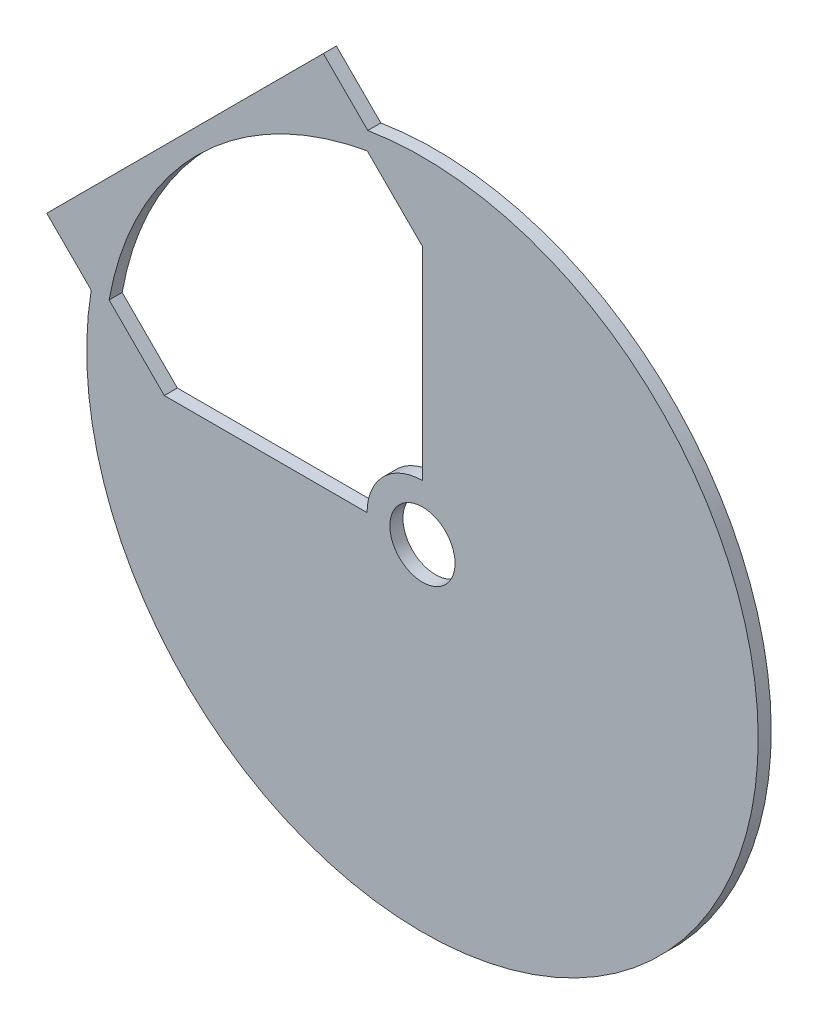
ISO-10303-21;
HEADER;
FILE_DESCRIPTION(('STEP AP214'),'2;1');
FILE_NAME('part.step','',(''),(''),'','','');
FILE_SCHEMA(('AUTOMOTIVE_DESIGN { 1 0 10303 214 1 1 1 1 }'));
ENDSEC;
DATA;
#1=APPLICATION_CONTEXT('core data for automotive mechanical design processes');
#2=APPLICATION_PROTOCOL_DEFINITION('international standard','automotive_design',2000,#1);
#3=PRODUCT_CONTEXT('',#1,'mechanical');
#4=PRODUCT('Part','Part','',(#3));
#5=PRODUCT_RELATED_PRODUCT_CATEGORY('part','',(#4));
#6=PRODUCT_DEFINITION_FORMATION('','',#4);
#7=PRODUCT_DEFINITION_CONTEXT('part definition',#1,'design');
#8=PRODUCT_DEFINITION('design','',#6,#7);
#9=PRODUCT_DEFINITION_SHAPE('','',#8);
#10=(LENGTH_UNIT() NAMED_UNIT(*) SI_UNIT(.MILLI.,.METRE.));
#11=(NAMED_UNIT(*) PLANE_ANGLE_UNIT() SI_UNIT($,.RADIAN.));
#12=(NAMED_UNIT(*) SI_UNIT($,.STERADIAN.) SOLID_ANGLE_UNIT());
#13=UNCERTAINTY_MEASURE_WITH_UNIT(LENGTH_MEASURE(1.E-05),#10,'distance_accuracy_value','');
#14=(GEOMETRIC_REPRESENTATION_CONTEXT(3) GLOBAL_UNCERTAINTY_ASSIGNED_CONTEXT((#13)) GLOBAL_UNIT_ASSIGNED_CONTEXT((#10,
#11,#12)) REPRESENTATION_CONTEXT('',''));
#15=CARTESIAN_POINT('',(0.,0.,0.));
#16=DIRECTION('',(0.,0.,1.));
#17=DIRECTION('',(1.,0.,0.));
#18=AXIS2_PLACEMENT_3D('',#15,#16,#17);
#19=CARTESIAN_POINT('',(0.,0.,0.));
#20=DIRECTION('',(0.,0.,-1.));
#21=DIRECTION('',(-1.,0.,0.));
#22=AXIS2_PLACEMENT_3D('',#19,#20,#21);
#23=CYLINDRICAL_SURFACE('',#22,48.8);
#24=DIRECTION('',(0.,0.,1.));
#25=VECTOR('',#24,1.);
#26=CARTESIAN_POINT('',(-48.0606246454725,8.46264489902557,0.));
#27=LINE('',#26,#25);
#28=CARTESIAN_POINT('',(-48.0606246454725,8.46264489902549,-2.));
#29=VERTEX_POINT('',#28);
#30=CARTESIAN_POINT('',(-48.0606246454725,8.46264489902557,0.));
#31=VERTEX_POINT('',#30);
#32=EDGE_CURVE('E11',#29,#31,#27,.T.);
#33=ORIENTED_EDGE('',*,*,#32,.F.);
#34=CARTESIAN_POINT('',(0.,0.,-2.));
#35=DIRECTION('',(0.,0.,1.));
#36=DIRECTION('',(1.,0.,0.));
#37=AXIS2_PLACEMENT_3D('',#34,#35,#36);
#38=CIRCLE('',#37,48.8);
#39=CARTESIAN_POINT('',(-8.46264489902599,48.0606246454725,-1.99999999999999));
#40=VERTEX_POINT('',#39);
#41=EDGE_CURVE('E115',#40,#29,#38,.T.);
#42=ORIENTED_EDGE('',*,*,#41,.F.);
#43=DIRECTION('',(0.,0.,1.));
#44=VECTOR('',#43,1.);
#45=CARTESIAN_POINT('',(-8.46264489902608,48.0606246454724,0.));
#46=LINE('',#45,#44);
#47=CARTESIAN_POINT('',(-8.46264489902608,48.0606246454724,0.));
#48=VERTEX_POINT('',#47);
#49=EDGE_CURVE('E51',#40,#48,#46,.T.);
#50=ORIENTED_EDGE('',*,*,#49,.T.);
#51=CARTESIAN_POINT('',(0.,0.,0.));
#52=DIRECTION('',(0.,0.,1.));
#53=DIRECTION('',(1.,0.,0.));
#54=AXIS2_PLACEMENT_3D('',#51,#52,#53);
#55=CIRCLE('',#54,48.8);
#56=EDGE_CURVE('E159',#48,#31,#55,.T.);
#57=ORIENTED_EDGE('',*,*,#56,.T.);
#58=EDGE_LOOP('',(#33,#42,#50,#57));
#59=FACE_BOUND('',#58,.T.);
#60=ADVANCED_FACE('F41',(#59),#23,.F.);
#61=CARTESIAN_POINT('',(19.7989898732232,19.7989898732234,0.));
#62=DIRECTION('',(0.707106781186544,0.707106781186551,0.));
#63=DIRECTION('',(0.707106781186552,-0.707106781186545,0.));
#64=AXIS2_PLACEMENT_3D('',#61,#62,#63);
#65=PLANE('',#64);
#66=ORIENTED_EDGE('',*,*,#49,.F.);
#67=DIRECTION('',(0.707106781186552,-0.707106781186545,0.));
#68=VECTOR('',#67,1.);
#69=CARTESIAN_POINT('',(19.7989898732232,19.7989898732234,-2.));
#70=LINE('',#69,#68);
#71=CARTESIAN_POINT('',(0.,39.5979797464465,-2.));
#72=VERTEX_POINT('',#71);
#73=EDGE_CURVE('E133',#40,#72,#70,.T.);
#74=ORIENTED_EDGE('',*,*,#73,.T.);
#75=DIRECTION('',(0.,0.,1.));
#76=VECTOR('',#75,1.);
#77=CARTESIAN_POINT('',(0.,39.5979797464465,0.));
#78=LINE('',#77,#76);
#79=CARTESIAN_POINT('',(0.,39.5979797464465,0.));
#80=VERTEX_POINT('',#79);
#81=EDGE_CURVE('E152',#72,#80,#78,.T.);
#82=ORIENTED_EDGE('',*,*,#81,.T.);
#83=DIRECTION('',(0.707106781186552,-0.707106781186545,0.));
#84=VECTOR('',#83,1.);
#85=CARTESIAN_POINT('',(19.7989898732232,19.7989898732234,0.));
#86=LINE('',#85,#84);
#87=EDGE_CURVE('E167',#48,#80,#86,.T.);
#88=ORIENTED_EDGE('',*,*,#87,.F.);
#89=EDGE_LOOP('',(#66,#74,#82,#88));
#90=FACE_BOUND('',#89,.T.);
#91=ADVANCED_FACE('F170',(#90),#65,.F.);
#92=CARTESIAN_POINT('',(0.,0.,0.));
#93=DIRECTION('',(-1.,0.,0.));
#94=DIRECTION('',(0.,1.,0.));
#95=AXIS2_PLACEMENT_3D('',#92,#93,#94);
#96=PLANE('',#95);
#97=ORIENTED_EDGE('',*,*,#81,.F.);
#98=DIRECTION('',(0.,1.,0.));
#99=VECTOR('',#98,1.);
#100=CARTESIAN_POINT('',(0.,0.,-2.));
#101=LINE('',#100,#99);
#102=CARTESIAN_POINT('',(0.,8.49999999999999,-2.));
#103=VERTEX_POINT('',#102);
#104=EDGE_CURVE('E130',#103,#72,#101,.T.);
#105=ORIENTED_EDGE('',*,*,#104,.F.);
#106=DIRECTION('',(0.,0.,1.));
#107=VECTOR('',#106,1.);
#108=CARTESIAN_POINT('',(0.,8.5,0.));
#109=LINE('',#108,#107);
#110=CARTESIAN_POINT('',(0.,8.5,0.));
#111=VERTEX_POINT('',#110);
#112=EDGE_CURVE('E150',#103,#111,#109,.T.);
#113=ORIENTED_EDGE('',*,*,#112,.T.);
#114=DIRECTION('',(0.,1.,0.));
#115=VECTOR('',#114,1.);
#116=CARTESIAN_POINT('',(0.,0.,0.));
#117=LINE('',#116,#115);
#118=EDGE_CURVE('E171',#111,#80,#117,.T.);
#119=ORIENTED_EDGE('',*,*,#118,.T.);
#120=EDGE_LOOP('',(#97,#105,#113,#119));
#121=FACE_BOUND('',#120,.T.);
#122=ADVANCED_FACE('F229',(#121),#96,.T.);
#123=CARTESIAN_POINT('',(0.,0.,0.));
#124=DIRECTION('',(0.,0.,-1.));
#125=DIRECTION('',(-1.,0.,0.));
#126=AXIS2_PLACEMENT_3D('',#123,#124,#125);
#127=CYLINDRICAL_SURFACE('',#126,8.49999999999999);
#128=ORIENTED_EDGE('',*,*,#112,.F.);
#129=CARTESIAN_POINT('',(0.,0.,-2.));
#130=DIRECTION('',(0.,0.,1.));
#131=DIRECTION('',(1.,0.,0.));
#132=AXIS2_PLACEMENT_3D('',#129,#130,#131);
#133=CIRCLE('',#132,8.49999999999999);
#134=CARTESIAN_POINT('',(-8.49999999999999,0.,-2.));
#135=VERTEX_POINT('',#134);
#136=EDGE_CURVE('E127',#103,#135,#133,.T.);
#137=ORIENTED_EDGE('',*,*,#136,.T.);
#138=DIRECTION('',(0.,0.,1.));
#139=VECTOR('',#138,1.);
#140=CARTESIAN_POINT('',(-8.5,0.,0.));
#141=LINE('',#140,#139);
#142=CARTESIAN_POINT('',(-8.5,0.,0.));
#143=VERTEX_POINT('',#142);
#144=EDGE_CURVE('E59',#135,#143,#141,.T.);
#145=ORIENTED_EDGE('',*,*,#144,.T.);
#146=CARTESIAN_POINT('',(0.,0.,0.));
#147=DIRECTION('',(0.,0.,1.));
#148=DIRECTION('',(1.,0.,0.));
#149=AXIS2_PLACEMENT_3D('',#146,#147,#148);
#150=CIRCLE('',#149,8.49999999999999);
#151=EDGE_CURVE('E148',#111,#143,#150,.T.);
#152=ORIENTED_EDGE('',*,*,#151,.F.);
#153=EDGE_LOOP('',(#128,#137,#145,#152));
#154=FACE_BOUND('',#153,.T.);
#155=ADVANCED_FACE('F226',(#154),#127,.T.);
#156=CARTESIAN_POINT('',(0.,-4.30211422042248E-13,0.));
#157=DIRECTION('',(0.,-1.,0.));
#158=DIRECTION('',(-1.,0.,0.));
#159=AXIS2_PLACEMENT_3D('',#156,#157,#158);
#160=PLANE('',#159);
#161=ORIENTED_EDGE('',*,*,#144,.F.);
#162=DIRECTION('',(-1.,0.,0.));
#163=VECTOR('',#162,1.);
#164=CARTESIAN_POINT('',(0.,0.,-2.));
#165=LINE('',#164,#163);
#166=CARTESIAN_POINT('',(-39.5979797464465,-3.81763039967688E-13,-1.99999999999999));
#167=VERTEX_POINT('',#166);
#168=EDGE_CURVE('E113',#135,#167,#165,.T.);
#169=ORIENTED_EDGE('',*,*,#168,.T.);
#170=DIRECTION('',(0.,0.,1.));
#171=VECTOR('',#170,1.);
#172=CARTESIAN_POINT('',(-39.5979797464465,-3.81639164714898E-13,0.));
#173=LINE('',#172,#171);
#174=CARTESIAN_POINT('',(-39.5979797464465,-3.81639164714898E-13,0.));
#175=VERTEX_POINT('',#174);
#176=EDGE_CURVE('E45',#167,#175,#173,.T.);
#177=ORIENTED_EDGE('',*,*,#176,.T.);
#178=DIRECTION('',(-1.,0.,0.));
#179=VECTOR('',#178,1.);
#180=CARTESIAN_POINT('',(0.,-4.30211422042248E-13,0.));
#181=LINE('',#180,#179);
#182=EDGE_CURVE('E222',#143,#175,#181,.T.);
#183=ORIENTED_EDGE('',*,*,#182,.F.);
#184=EDGE_LOOP('',(#161,#169,#177,#183));
#185=FACE_BOUND('',#184,.T.);
#186=ADVANCED_FACE('F117',(#185),#160,.F.);
#187=CARTESIAN_POINT('',(-57.6292026667038,15.2027957955105,0.));
#188=DIRECTION('',(-0.707106781186544,-0.707106781186551,0.));
#189=DIRECTION('',(-0.707106781186552,0.707106781186545,0.));
#190=AXIS2_PLACEMENT_3D('',#187,#188,#189);
#191=PLANE('',#190);
#192=DIRECTION('',(0.,0.,1.));
#193=VECTOR('',#192,1.);
#194=CARTESIAN_POINT('',(-57.6292026667038,15.2027957955105,0.));
#195=LINE('',#194,#193);
#196=CARTESIAN_POINT('',(-57.6292026667038,15.2027957955105,-1.99999999999999));
#197=VERTEX_POINT('',#196);
#198=CARTESIAN_POINT('',(-57.6292026667038,15.2027957955105,0.));
#199=VERTEX_POINT('',#198);
#200=EDGE_CURVE('E108',#197,#199,#195,.T.);
#201=ORIENTED_EDGE('',*,*,#200,.F.);
#202=DIRECTION('',(-0.707106781186552,0.707106781186545,0.));
#203=VECTOR('',#202,1.);
#204=CARTESIAN_POINT('',(-57.6292026667038,15.2027957955105,-2.));
#205=LINE('',#204,#203);
#206=CARTESIAN_POINT('',(-50.8126122134759,8.38620534228259,-2.));
#207=VERTEX_POINT('',#206);
#208=EDGE_CURVE('E121',#207,#197,#205,.T.);
#209=ORIENTED_EDGE('',*,*,#208,.F.);
#210=DIRECTION('',(0.,0.,1.));
#211=VECTOR('',#210,1.);
#212=CARTESIAN_POINT('',(-50.8126122134759,8.38620534228268,0.));
#213=LINE('',#212,#211);
#214=CARTESIAN_POINT('',(-50.8126122134759,8.38620534228268,0.));
#215=VERTEX_POINT('',#214);
#216=EDGE_CURVE('E140',#207,#215,#213,.T.);
#217=ORIENTED_EDGE('',*,*,#216,.T.);
#218=DIRECTION('',(-0.707106781186552,0.707106781186545,0.));
#219=VECTOR('',#218,1.);
#220=CARTESIAN_POINT('',(-57.6292026667038,15.2027957955105,0.));
#221=LINE('',#220,#219);
#222=EDGE_CURVE('E218',#215,#199,#221,.T.);
#223=ORIENTED_EDGE('',*,*,#222,.T.);
#224=EDGE_LOOP('',(#201,#209,#217,#223));
#225=FACE_BOUND('',#224,.T.);
#226=ADVANCED_FACE('F220',(#225),#191,.T.);
#227=CARTESIAN_POINT('',(0.,0.,0.));
#228=DIRECTION('',(0.,0.,-1.));
#229=DIRECTION('',(-1.,0.,0.));
#230=AXIS2_PLACEMENT_3D('',#227,#228,#229);
#231=CYLINDRICAL_SURFACE('',#230,51.5);
#232=ORIENTED_EDGE('',*,*,#216,.F.);
#233=CARTESIAN_POINT('',(0.,0.,-2.));
#234=DIRECTION('',(0.,0.,-1.));
#235=DIRECTION('',(-1.,0.,0.));
#236=AXIS2_PLACEMENT_3D('',#233,#234,#235);
#237=CIRCLE('',#236,51.5);
#238=CARTESIAN_POINT('',(-8.38620534228314,50.8126122134758,-1.99999999999999));
#239=VERTEX_POINT('',#238);
#240=EDGE_CURVE('E118',#239,#207,#237,.T.);
#241=ORIENTED_EDGE('',*,*,#240,.F.);
#242=DIRECTION('',(0.,0.,1.));
#243=VECTOR('',#242,1.);
#244=CARTESIAN_POINT('',(-8.38620534228322,50.8126122134757,0.));
#245=LINE('',#244,#243);
#246=CARTESIAN_POINT('',(-8.38620534228322,50.8126122134757,0.));
#247=VERTEX_POINT('',#246);
#248=EDGE_CURVE('E137',#239,#247,#245,.T.);
#249=ORIENTED_EDGE('',*,*,#248,.T.);
#250=CARTESIAN_POINT('',(0.,0.,0.));
#251=DIRECTION('',(0.,0.,-1.));
#252=DIRECTION('',(-1.,0.,0.));
#253=AXIS2_PLACEMENT_3D('',#250,#251,#252);
#254=CIRCLE('',#253,51.5);
#255=EDGE_CURVE('E202',#247,#215,#254,.T.);
#256=ORIENTED_EDGE('',*,*,#255,.T.);
#257=EDGE_LOOP('',(#232,#241,#249,#256));
#258=FACE_BOUND('',#257,.T.);
#259=ADVANCED_FACE('F200',(#258),#231,.T.);
#260=CARTESIAN_POINT('',(-15.2027957955111,57.6292026667036,0.));
#261=DIRECTION('',(0.707106781186545,0.70710678118655,0.));
#262=DIRECTION('',(0.707106781186551,-0.707106781186546,0.));
#263=AXIS2_PLACEMENT_3D('',#260,#261,#262);
#264=PLANE('',#263);
#265=ORIENTED_EDGE('',*,*,#248,.F.);
#266=DIRECTION('',(0.707106781186551,-0.707106781186546,0.));
#267=VECTOR('',#266,1.);
#268=CARTESIAN_POINT('',(-15.2027957955111,57.6292026667036,-2.));
#269=LINE('',#268,#267);
#270=CARTESIAN_POINT('',(-15.2027957955111,57.6292026667036,-2.));
#271=VERTEX_POINT('',#270);
#272=EDGE_CURVE('E181',#271,#239,#269,.T.);
#273=ORIENTED_EDGE('',*,*,#272,.F.);
#274=DIRECTION('',(0.,0.,1.));
#275=VECTOR('',#274,1.);
#276=CARTESIAN_POINT('',(-15.2027957955111,57.6292026667036,0.));
#277=LINE('',#276,#275);
#278=CARTESIAN_POINT('',(-15.2027957955111,57.6292026667036,0.));
#279=VERTEX_POINT('',#278);
#280=EDGE_CURVE('E141',#271,#279,#277,.T.);
#281=ORIENTED_EDGE('',*,*,#280,.T.);
#282=DIRECTION('',(0.707106781186551,-0.707106781186546,0.));
#283=VECTOR('',#282,1.);
#284=CARTESIAN_POINT('',(-15.2027957955111,57.6292026667036,0.));
#285=LINE('',#284,#283);
#286=EDGE_CURVE('E196',#279,#247,#285,.T.);
#287=ORIENTED_EDGE('',*,*,#286,.T.);
#288=EDGE_LOOP('',(#265,#273,#281,#287));
#289=FACE_BOUND('',#288,.T.);
#290=ADVANCED_FACE('F192',(#289),#264,.T.);
#291=CARTESIAN_POINT('',(0.,0.,0.));
#292=DIRECTION('',(0.,0.,-1.));
#293=DIRECTION('',(-1.,0.,0.));
#294=AXIS2_PLACEMENT_3D('',#291,#292,#293);
#295=CYLINDRICAL_SURFACE('',#294,5.);
#296=CARTESIAN_POINT('',(0.,0.,0.));
#297=DIRECTION('',(0.,0.,1.));
#298=DIRECTION('',(1.,0.,0.));
#299=AXIS2_PLACEMENT_3D('',#296,#297,#298);
#300=CIRCLE('',#299,5.);
#301=CARTESIAN_POINT('',(5.,0.,0.));
#302=VERTEX_POINT('',#301);
#303=EDGE_CURVE('E129',#302,#302,#300,.T.);
#304=ORIENTED_EDGE('',*,*,#303,.T.);
#305=EDGE_LOOP('',(#304));
#306=FACE_BOUND('',#305,.T.);
#307=CARTESIAN_POINT('',(0.,0.,-2.));
#308=DIRECTION('',(0.,0.,1.));
#309=DIRECTION('',(1.,0.,0.));
#310=AXIS2_PLACEMENT_3D('',#307,#308,#309);
#311=CIRCLE('',#310,5.);
#312=CARTESIAN_POINT('',(5.,0.,-2.));
#313=VERTEX_POINT('',#312);
#314=EDGE_CURVE('E178',#313,#313,#311,.T.);
#315=ORIENTED_EDGE('',*,*,#314,.F.);
#316=EDGE_LOOP('',(#315));
#317=FACE_BOUND('',#316,.T.);
#318=ADVANCED_FACE('F295',(#306,#317),#295,.F.);
#319=CARTESIAN_POINT('',(-15.2027957955111,57.6292026667036,0.));
#320=DIRECTION('',(-0.707106781186551,0.707106781186544,0.));
#321=DIRECTION('',(0.707106781186544,0.707106781186551,0.));
#322=AXIS2_PLACEMENT_3D('',#319,#320,#321);
#323=PLANE('',#322);
#324=DIRECTION('',(0.707106781186544,0.707106781186551,0.));
#325=VECTOR('',#324,1.);
#326=CARTESIAN_POINT('',(-15.2027957955111,57.6292026667036,-2.));
#327=LINE('',#326,#325);
#328=EDGE_CURVE('E125',#197,#271,#327,.T.);
#329=ORIENTED_EDGE('',*,*,#328,.F.);
#330=ORIENTED_EDGE('',*,*,#200,.T.);
#331=DIRECTION('',(0.707106781186544,0.707106781186551,0.));
#332=VECTOR('',#331,1.);
#333=CARTESIAN_POINT('',(-15.2027957955111,57.6292026667036,0.));
#334=LINE('',#333,#332);
#335=EDGE_CURVE('E213',#199,#279,#334,.T.);
#336=ORIENTED_EDGE('',*,*,#335,.T.);
#337=ORIENTED_EDGE('',*,*,#280,.F.);
#338=EDGE_LOOP('',(#329,#330,#336,#337));
#339=FACE_BOUND('',#338,.T.);
#340=ADVANCED_FACE('F212',(#339),#323,.T.);
#341=CARTESIAN_POINT('',(-19.7989898732232,-19.7989898732234,0.));
#342=DIRECTION('',(0.707106781186544,0.707106781186551,0.));
#343=DIRECTION('',(0.707106781186552,-0.707106781186545,0.));
#344=AXIS2_PLACEMENT_3D('',#341,#342,#343);
#345=PLANE('',#344);
#346=DIRECTION('',(0.707106781186552,-0.707106781186545,0.));
#347=VECTOR('',#346,1.);
#348=CARTESIAN_POINT('',(-19.7989898732232,-19.7989898732234,-2.));
#349=LINE('',#348,#347);
#350=EDGE_CURVE('E101',#29,#167,#349,.T.);
#351=ORIENTED_EDGE('',*,*,#350,.F.);
#352=ORIENTED_EDGE('',*,*,#32,.T.);
#353=DIRECTION('',(0.707106781186552,-0.707106781186545,0.));
#354=VECTOR('',#353,1.);
#355=CARTESIAN_POINT('',(-19.7989898732232,-19.7989898732234,0.));
#356=LINE('',#355,#354);
#357=EDGE_CURVE('E104',#31,#175,#356,.T.);
#358=ORIENTED_EDGE('',*,*,#357,.T.);
#359=ORIENTED_EDGE('',*,*,#176,.F.);
#360=EDGE_LOOP('',(#351,#352,#358,#359));
#361=FACE_BOUND('',#360,.T.);
#362=ADVANCED_FACE('F43',(#361),#345,.T.);
#363=CARTESIAN_POINT('',(0.,0.,0.));
#364=DIRECTION('',(0.,0.,-1.));
#365=DIRECTION('',(-1.,0.,0.));
#366=AXIS2_PLACEMENT_3D('',#363,#364,#365);
#367=PLANE('',#366);
#368=ORIENTED_EDGE('',*,*,#303,.F.);
#369=EDGE_LOOP('',(#368));
#370=FACE_BOUND('',#369,.T.);
#371=ORIENTED_EDGE('',*,*,#286,.F.);
#372=ORIENTED_EDGE('',*,*,#335,.F.);
#373=ORIENTED_EDGE('',*,*,#222,.F.);
#374=ORIENTED_EDGE('',*,*,#255,.F.);
#375=EDGE_LOOP('',(#371,#372,#373,#374));
#376=FACE_BOUND('',#375,.T.);
#377=ORIENTED_EDGE('',*,*,#182,.T.);
#378=ORIENTED_EDGE('',*,*,#357,.F.);
#379=ORIENTED_EDGE('',*,*,#56,.F.);
#380=ORIENTED_EDGE('',*,*,#87,.T.);
#381=ORIENTED_EDGE('',*,*,#118,.F.);
#382=ORIENTED_EDGE('',*,*,#151,.T.);
#383=EDGE_LOOP('',(#377,#378,#379,#380,#381,#382));
#384=FACE_BOUND('',#383,.T.);
#385=ADVANCED_FACE('F165',(#370,#376,#384),#367,.F.);
#386=CARTESIAN_POINT('',(0.,0.,-2.));
#387=DIRECTION('',(0.,0.,-1.));
#388=DIRECTION('',(-1.,0.,0.));
#389=AXIS2_PLACEMENT_3D('',#386,#387,#388);
#390=PLANE('',#389);
#391=ORIENTED_EDGE('',*,*,#314,.T.);
#392=EDGE_LOOP('',(#391));
#393=FACE_BOUND('',#392,.T.);
#394=ORIENTED_EDGE('',*,*,#272,.T.);
#395=ORIENTED_EDGE('',*,*,#240,.T.);
#396=ORIENTED_EDGE('',*,*,#208,.T.);
#397=ORIENTED_EDGE('',*,*,#328,.T.);
#398=EDGE_LOOP('',(#394,#395,#396,#397));
#399=FACE_BOUND('',#398,.T.);
#400=ORIENTED_EDGE('',*,*,#168,.F.);
#401=ORIENTED_EDGE('',*,*,#136,.F.);
#402=ORIENTED_EDGE('',*,*,#104,.T.);
#403=ORIENTED_EDGE('',*,*,#73,.F.);
#404=ORIENTED_EDGE('',*,*,#41,.T.);
#405=ORIENTED_EDGE('',*,*,#350,.T.);
#406=EDGE_LOOP('',(#400,#401,#402,#403,#404,#405));
#407=FACE_BOUND('',#406,.T.);
#408=ADVANCED_FACE('F111',(#393,#399,#407),#390,.T.);
#409=CLOSED_SHELL('',(#60,#91,#122,#155,#186,#226,#259,#290,#318,#340,#362,#385,#408));
#410=MANIFOLD_SOLID_BREP('B2',#409);
#411=ADVANCED_BREP_SHAPE_REPRESENTATION('',(#18,#410),#14);
#412=SHAPE_DEFINITION_REPRESENTATION(#9,#411);
ENDSEC;
END-ISO-10303-21;
